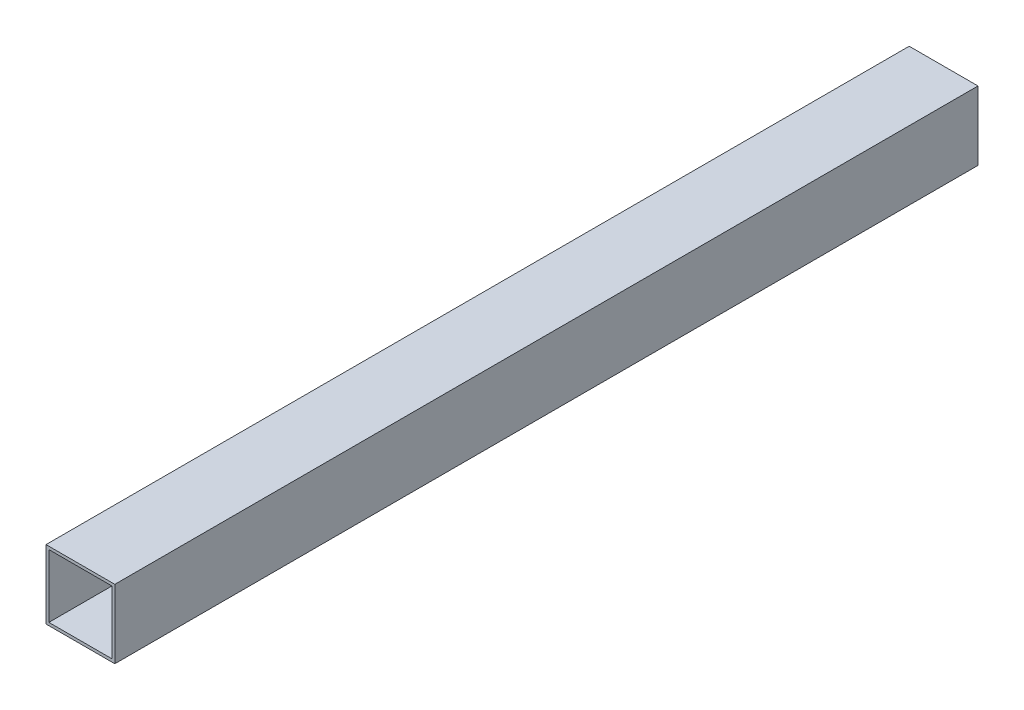
ISO-10303-21;
HEADER;
FILE_DESCRIPTION(('STEP AP214'),'2;1');
FILE_NAME('part.step','',(''),(''),'','','');
FILE_SCHEMA(('AUTOMOTIVE_DESIGN { 1 0 10303 214 1 1 1 1 }'));
ENDSEC;
DATA;
#1=APPLICATION_CONTEXT('core data for automotive mechanical design processes');
#2=APPLICATION_PROTOCOL_DEFINITION('international standard','automotive_design',2000,#1);
#3=PRODUCT_CONTEXT('',#1,'mechanical');
#4=PRODUCT('Part','Part','',(#3));
#5=PRODUCT_RELATED_PRODUCT_CATEGORY('part','',(#4));
#6=PRODUCT_DEFINITION_FORMATION('','',#4);
#7=PRODUCT_DEFINITION_CONTEXT('part definition',#1,'design');
#8=PRODUCT_DEFINITION('design','',#6,#7);
#9=PRODUCT_DEFINITION_SHAPE('','',#8);
#10=(LENGTH_UNIT() NAMED_UNIT(*) SI_UNIT(.MILLI.,.METRE.));
#11=(NAMED_UNIT(*) PLANE_ANGLE_UNIT() SI_UNIT($,.RADIAN.));
#12=(NAMED_UNIT(*) SI_UNIT($,.STERADIAN.) SOLID_ANGLE_UNIT());
#13=UNCERTAINTY_MEASURE_WITH_UNIT(LENGTH_MEASURE(1.E-05),#10,'distance_accuracy_value','');
#14=(GEOMETRIC_REPRESENTATION_CONTEXT(3) GLOBAL_UNCERTAINTY_ASSIGNED_CONTEXT((#13)) GLOBAL_UNIT_ASSIGNED_CONTEXT((#10,
#11,#12)) REPRESENTATION_CONTEXT('',''));
#15=CARTESIAN_POINT('',(0.,0.,0.));
#16=DIRECTION('',(0.,0.,1.));
#17=DIRECTION('',(1.,0.,0.));
#18=AXIS2_PLACEMENT_3D('',#15,#16,#17);
#19=CARTESIAN_POINT('',(0.,0.,914.4));
#20=DIRECTION('',(0.,0.,1.));
#21=DIRECTION('',(1.,0.,0.));
#22=AXIS2_PLACEMENT_3D('',#19,#20,#21);
#23=PLANE('',#22);
#24=DIRECTION('',(0.,-1.,0.));
#25=VECTOR('',#24,1.);
#26=CARTESIAN_POINT('',(-36.449,-36.449,914.4));
#27=LINE('',#26,#25);
#28=CARTESIAN_POINT('',(-36.449,36.449,914.4));
#29=VERTEX_POINT('',#28);
#30=CARTESIAN_POINT('',(-36.449,-36.449,914.4));
#31=VERTEX_POINT('',#30);
#32=EDGE_CURVE('E134',#29,#31,#27,.T.);
#33=ORIENTED_EDGE('',*,*,#32,.T.);
#34=DIRECTION('',(1.,0.,0.));
#35=VECTOR('',#34,1.);
#36=CARTESIAN_POINT('',(36.449,-36.449,914.4));
#37=LINE('',#36,#35);
#38=CARTESIAN_POINT('',(36.449,-36.449,914.4));
#39=VERTEX_POINT('',#38);
#40=EDGE_CURVE('E137',#31,#39,#37,.T.);
#41=ORIENTED_EDGE('',*,*,#40,.T.);
#42=DIRECTION('',(0.,1.,0.));
#43=VECTOR('',#42,1.);
#44=CARTESIAN_POINT('',(36.449,-36.449,914.4));
#45=LINE('',#44,#43);
#46=CARTESIAN_POINT('',(36.449,36.449,914.4));
#47=VERTEX_POINT('',#46);
#48=EDGE_CURVE('E140',#39,#47,#45,.T.);
#49=ORIENTED_EDGE('',*,*,#48,.T.);
#50=DIRECTION('',(-1.,0.,0.));
#51=VECTOR('',#50,1.);
#52=CARTESIAN_POINT('',(36.449,36.449,914.4));
#53=LINE('',#52,#51);
#54=EDGE_CURVE('E142',#47,#29,#53,.T.);
#55=ORIENTED_EDGE('',*,*,#54,.T.);
#56=EDGE_LOOP('',(#33,#41,#49,#55));
#57=FACE_BOUND('',#56,.T.);
#58=DIRECTION('',(-1.,0.,0.));
#59=VECTOR('',#58,1.);
#60=CARTESIAN_POINT('',(-33.401,33.401,914.4));
#61=LINE('',#60,#59);
#62=CARTESIAN_POINT('',(33.401,33.401,914.4));
#63=VERTEX_POINT('',#62);
#64=CARTESIAN_POINT('',(-33.401,33.401,914.4));
#65=VERTEX_POINT('',#64);
#66=EDGE_CURVE('E106',#63,#65,#61,.T.);
#67=ORIENTED_EDGE('',*,*,#66,.F.);
#68=DIRECTION('',(0.,1.,0.));
#69=VECTOR('',#68,1.);
#70=CARTESIAN_POINT('',(33.401,33.401,914.4));
#71=LINE('',#70,#69);
#72=CARTESIAN_POINT('',(33.401,-33.401,914.4));
#73=VERTEX_POINT('',#72);
#74=EDGE_CURVE('E98',#73,#63,#71,.T.);
#75=ORIENTED_EDGE('',*,*,#74,.F.);
#76=DIRECTION('',(1.,0.,0.));
#77=VECTOR('',#76,1.);
#78=CARTESIAN_POINT('',(-33.401,-33.401,914.4));
#79=LINE('',#78,#77);
#80=CARTESIAN_POINT('',(-33.401,-33.401,914.4));
#81=VERTEX_POINT('',#80);
#82=EDGE_CURVE('E120',#81,#73,#79,.T.);
#83=ORIENTED_EDGE('',*,*,#82,.F.);
#84=DIRECTION('',(0.,-1.,0.));
#85=VECTOR('',#84,1.);
#86=CARTESIAN_POINT('',(-33.401,33.401,914.4));
#87=LINE('',#86,#85);
#88=EDGE_CURVE('E118',#65,#81,#87,.T.);
#89=ORIENTED_EDGE('',*,*,#88,.F.);
#90=EDGE_LOOP('',(#67,#75,#83,#89));
#91=FACE_BOUND('',#90,.T.);
#92=ADVANCED_FACE('F33',(#57,#91),#23,.T.);
#93=CARTESIAN_POINT('',(0.,0.,0.));
#94=DIRECTION('',(0.,0.,1.));
#95=DIRECTION('',(1.,0.,0.));
#96=AXIS2_PLACEMENT_3D('',#93,#94,#95);
#97=PLANE('',#96);
#98=DIRECTION('',(0.,-1.,0.));
#99=VECTOR('',#98,1.);
#100=CARTESIAN_POINT('',(-36.449,-36.449,0.));
#101=LINE('',#100,#99);
#102=CARTESIAN_POINT('',(-36.449,36.449,0.));
#103=VERTEX_POINT('',#102);
#104=CARTESIAN_POINT('',(-36.449,-36.449,0.));
#105=VERTEX_POINT('',#104);
#106=EDGE_CURVE('E114',#103,#105,#101,.T.);
#107=ORIENTED_EDGE('',*,*,#106,.F.);
#108=DIRECTION('',(-1.,0.,0.));
#109=VECTOR('',#108,1.);
#110=CARTESIAN_POINT('',(36.449,36.449,0.));
#111=LINE('',#110,#109);
#112=CARTESIAN_POINT('',(36.449,36.449,0.));
#113=VERTEX_POINT('',#112);
#114=EDGE_CURVE('E138',#113,#103,#111,.T.);
#115=ORIENTED_EDGE('',*,*,#114,.F.);
#116=DIRECTION('',(0.,1.,0.));
#117=VECTOR('',#116,1.);
#118=CARTESIAN_POINT('',(36.449,-36.449,0.));
#119=LINE('',#118,#117);
#120=CARTESIAN_POINT('',(36.449,-36.449,0.));
#121=VERTEX_POINT('',#120);
#122=EDGE_CURVE('E149',#121,#113,#119,.T.);
#123=ORIENTED_EDGE('',*,*,#122,.F.);
#124=DIRECTION('',(1.,0.,0.));
#125=VECTOR('',#124,1.);
#126=CARTESIAN_POINT('',(36.449,-36.449,0.));
#127=LINE('',#126,#125);
#128=EDGE_CURVE('E147',#105,#121,#127,.T.);
#129=ORIENTED_EDGE('',*,*,#128,.F.);
#130=EDGE_LOOP('',(#107,#115,#123,#129));
#131=FACE_BOUND('',#130,.T.);
#132=DIRECTION('',(0.,1.,0.));
#133=VECTOR('',#132,1.);
#134=CARTESIAN_POINT('',(33.401,33.401,0.));
#135=LINE('',#134,#133);
#136=CARTESIAN_POINT('',(33.401,-33.401,0.));
#137=VERTEX_POINT('',#136);
#138=CARTESIAN_POINT('',(33.401,33.401,0.));
#139=VERTEX_POINT('',#138);
#140=EDGE_CURVE('E56',#137,#139,#135,.T.);
#141=ORIENTED_EDGE('',*,*,#140,.T.);
#142=DIRECTION('',(-1.,0.,0.));
#143=VECTOR('',#142,1.);
#144=CARTESIAN_POINT('',(-33.401,33.401,0.));
#145=LINE('',#144,#143);
#146=CARTESIAN_POINT('',(-33.401,33.401,0.));
#147=VERTEX_POINT('',#146);
#148=EDGE_CURVE('E113',#139,#147,#145,.T.);
#149=ORIENTED_EDGE('',*,*,#148,.T.);
#150=DIRECTION('',(0.,-1.,0.));
#151=VECTOR('',#150,1.);
#152=CARTESIAN_POINT('',(-33.401,33.401,0.));
#153=LINE('',#152,#151);
#154=CARTESIAN_POINT('',(-33.401,-33.401,0.));
#155=VERTEX_POINT('',#154);
#156=EDGE_CURVE('E126',#147,#155,#153,.T.);
#157=ORIENTED_EDGE('',*,*,#156,.T.);
#158=DIRECTION('',(1.,0.,0.));
#159=VECTOR('',#158,1.);
#160=CARTESIAN_POINT('',(-33.401,-33.401,0.));
#161=LINE('',#160,#159);
#162=EDGE_CURVE('E107',#155,#137,#161,.T.);
#163=ORIENTED_EDGE('',*,*,#162,.T.);
#164=EDGE_LOOP('',(#141,#149,#157,#163));
#165=FACE_BOUND('',#164,.T.);
#166=ADVANCED_FACE('F167',(#131,#165),#97,.F.);
#167=CARTESIAN_POINT('',(-36.449,-36.449,914.4));
#168=DIRECTION('',(1.,0.,0.));
#169=DIRECTION('',(0.,0.,-1.));
#170=AXIS2_PLACEMENT_3D('',#167,#168,#169);
#171=PLANE('',#170);
#172=ORIENTED_EDGE('',*,*,#106,.T.);
#173=DIRECTION('',(0.,0.,-1.));
#174=VECTOR('',#173,1.);
#175=CARTESIAN_POINT('',(-36.449,-36.449,914.4));
#176=LINE('',#175,#174);
#177=EDGE_CURVE('E11',#31,#105,#176,.T.);
#178=ORIENTED_EDGE('',*,*,#177,.F.);
#179=ORIENTED_EDGE('',*,*,#32,.F.);
#180=DIRECTION('',(0.,0.,-1.));
#181=VECTOR('',#180,1.);
#182=CARTESIAN_POINT('',(-36.449,36.449,914.4));
#183=LINE('',#182,#181);
#184=EDGE_CURVE('E144',#29,#103,#183,.T.);
#185=ORIENTED_EDGE('',*,*,#184,.T.);
#186=EDGE_LOOP('',(#172,#178,#179,#185));
#187=FACE_BOUND('',#186,.T.);
#188=ADVANCED_FACE('F35',(#187),#171,.F.);
#189=CARTESIAN_POINT('',(36.449,-36.449,914.4));
#190=DIRECTION('',(0.,1.,0.));
#191=DIRECTION('',(-1.,0.,0.));
#192=AXIS2_PLACEMENT_3D('',#189,#190,#191);
#193=PLANE('',#192);
#194=ORIENTED_EDGE('',*,*,#128,.T.);
#195=DIRECTION('',(0.,0.,-1.));
#196=VECTOR('',#195,1.);
#197=CARTESIAN_POINT('',(36.449,-36.449,914.4));
#198=LINE('',#197,#196);
#199=EDGE_CURVE('E41',#39,#121,#198,.T.);
#200=ORIENTED_EDGE('',*,*,#199,.F.);
#201=ORIENTED_EDGE('',*,*,#40,.F.);
#202=ORIENTED_EDGE('',*,*,#177,.T.);
#203=EDGE_LOOP('',(#194,#200,#201,#202));
#204=FACE_BOUND('',#203,.T.);
#205=ADVANCED_FACE('F177',(#204),#193,.F.);
#206=CARTESIAN_POINT('',(36.449,-36.449,914.4));
#207=DIRECTION('',(-1.,0.,0.));
#208=DIRECTION('',(0.,0.,1.));
#209=AXIS2_PLACEMENT_3D('',#206,#207,#208);
#210=PLANE('',#209);
#211=ORIENTED_EDGE('',*,*,#122,.T.);
#212=DIRECTION('',(0.,0.,-1.));
#213=VECTOR('',#212,1.);
#214=CARTESIAN_POINT('',(36.449,36.449,914.4));
#215=LINE('',#214,#213);
#216=EDGE_CURVE('E154',#47,#113,#215,.T.);
#217=ORIENTED_EDGE('',*,*,#216,.F.);
#218=ORIENTED_EDGE('',*,*,#48,.F.);
#219=ORIENTED_EDGE('',*,*,#199,.T.);
#220=EDGE_LOOP('',(#211,#217,#218,#219));
#221=FACE_BOUND('',#220,.T.);
#222=ADVANCED_FACE('F161',(#221),#210,.F.);
#223=CARTESIAN_POINT('',(36.449,36.449,914.4));
#224=DIRECTION('',(0.,-1.,0.));
#225=DIRECTION('',(0.,0.,-1.));
#226=AXIS2_PLACEMENT_3D('',#223,#224,#225);
#227=PLANE('',#226);
#228=ORIENTED_EDGE('',*,*,#114,.T.);
#229=ORIENTED_EDGE('',*,*,#184,.F.);
#230=ORIENTED_EDGE('',*,*,#54,.F.);
#231=ORIENTED_EDGE('',*,*,#216,.T.);
#232=EDGE_LOOP('',(#228,#229,#230,#231));
#233=FACE_BOUND('',#232,.T.);
#234=ADVANCED_FACE('F171',(#233),#227,.F.);
#235=CARTESIAN_POINT('',(33.401,33.401,914.4));
#236=DIRECTION('',(-1.,0.,0.));
#237=DIRECTION('',(0.,-1.,0.));
#238=AXIS2_PLACEMENT_3D('',#235,#236,#237);
#239=PLANE('',#238);
#240=ORIENTED_EDGE('',*,*,#140,.F.);
#241=DIRECTION('',(0.,0.,-1.));
#242=VECTOR('',#241,1.);
#243=CARTESIAN_POINT('',(33.401,-33.401,914.4));
#244=LINE('',#243,#242);
#245=EDGE_CURVE('E102',#73,#137,#244,.T.);
#246=ORIENTED_EDGE('',*,*,#245,.F.);
#247=ORIENTED_EDGE('',*,*,#74,.T.);
#248=DIRECTION('',(0.,0.,-1.));
#249=VECTOR('',#248,1.);
#250=CARTESIAN_POINT('',(33.401,33.401,914.4));
#251=LINE('',#250,#249);
#252=EDGE_CURVE('E101',#63,#139,#251,.T.);
#253=ORIENTED_EDGE('',*,*,#252,.T.);
#254=EDGE_LOOP('',(#240,#246,#247,#253));
#255=FACE_BOUND('',#254,.T.);
#256=ADVANCED_FACE('F100',(#255),#239,.T.);
#257=CARTESIAN_POINT('',(-33.401,33.401,914.4));
#258=DIRECTION('',(0.,-1.,0.));
#259=DIRECTION('',(0.,0.,-1.));
#260=AXIS2_PLACEMENT_3D('',#257,#258,#259);
#261=PLANE('',#260);
#262=ORIENTED_EDGE('',*,*,#148,.F.);
#263=ORIENTED_EDGE('',*,*,#252,.F.);
#264=ORIENTED_EDGE('',*,*,#66,.T.);
#265=DIRECTION('',(0.,0.,-1.));
#266=VECTOR('',#265,1.);
#267=CARTESIAN_POINT('',(-33.401,33.401,914.4));
#268=LINE('',#267,#266);
#269=EDGE_CURVE('E115',#65,#147,#268,.T.);
#270=ORIENTED_EDGE('',*,*,#269,.T.);
#271=EDGE_LOOP('',(#262,#263,#264,#270));
#272=FACE_BOUND('',#271,.T.);
#273=ADVANCED_FACE('F110',(#272),#261,.T.);
#274=CARTESIAN_POINT('',(-33.401,33.401,914.4));
#275=DIRECTION('',(1.,0.,0.));
#276=DIRECTION('',(0.,1.,0.));
#277=AXIS2_PLACEMENT_3D('',#274,#275,#276);
#278=PLANE('',#277);
#279=ORIENTED_EDGE('',*,*,#156,.F.);
#280=ORIENTED_EDGE('',*,*,#269,.F.);
#281=ORIENTED_EDGE('',*,*,#88,.T.);
#282=DIRECTION('',(0.,0.,-1.));
#283=VECTOR('',#282,1.);
#284=CARTESIAN_POINT('',(-33.401,-33.401,914.4));
#285=LINE('',#284,#283);
#286=EDGE_CURVE('E48',#81,#155,#285,.T.);
#287=ORIENTED_EDGE('',*,*,#286,.T.);
#288=EDGE_LOOP('',(#279,#280,#281,#287));
#289=FACE_BOUND('',#288,.T.);
#290=ADVANCED_FACE('F200',(#289),#278,.T.);
#291=CARTESIAN_POINT('',(-33.401,-33.401,914.4));
#292=DIRECTION('',(0.,1.,0.));
#293=DIRECTION('',(-1.,0.,0.));
#294=AXIS2_PLACEMENT_3D('',#291,#292,#293);
#295=PLANE('',#294);
#296=ORIENTED_EDGE('',*,*,#162,.F.);
#297=ORIENTED_EDGE('',*,*,#286,.F.);
#298=ORIENTED_EDGE('',*,*,#82,.T.);
#299=ORIENTED_EDGE('',*,*,#245,.T.);
#300=EDGE_LOOP('',(#296,#297,#298,#299));
#301=FACE_BOUND('',#300,.T.);
#302=ADVANCED_FACE('F204',(#301),#295,.T.);
#303=CLOSED_SHELL('',(#92,#166,#188,#205,#222,#234,#256,#273,#290,#302));
#304=MANIFOLD_SOLID_BREP('B2',#303);
#305=ADVANCED_BREP_SHAPE_REPRESENTATION('',(#18,#304),#14);
#306=SHAPE_DEFINITION_REPRESENTATION(#9,#305);
ENDSEC;
END-ISO-10303-21;
